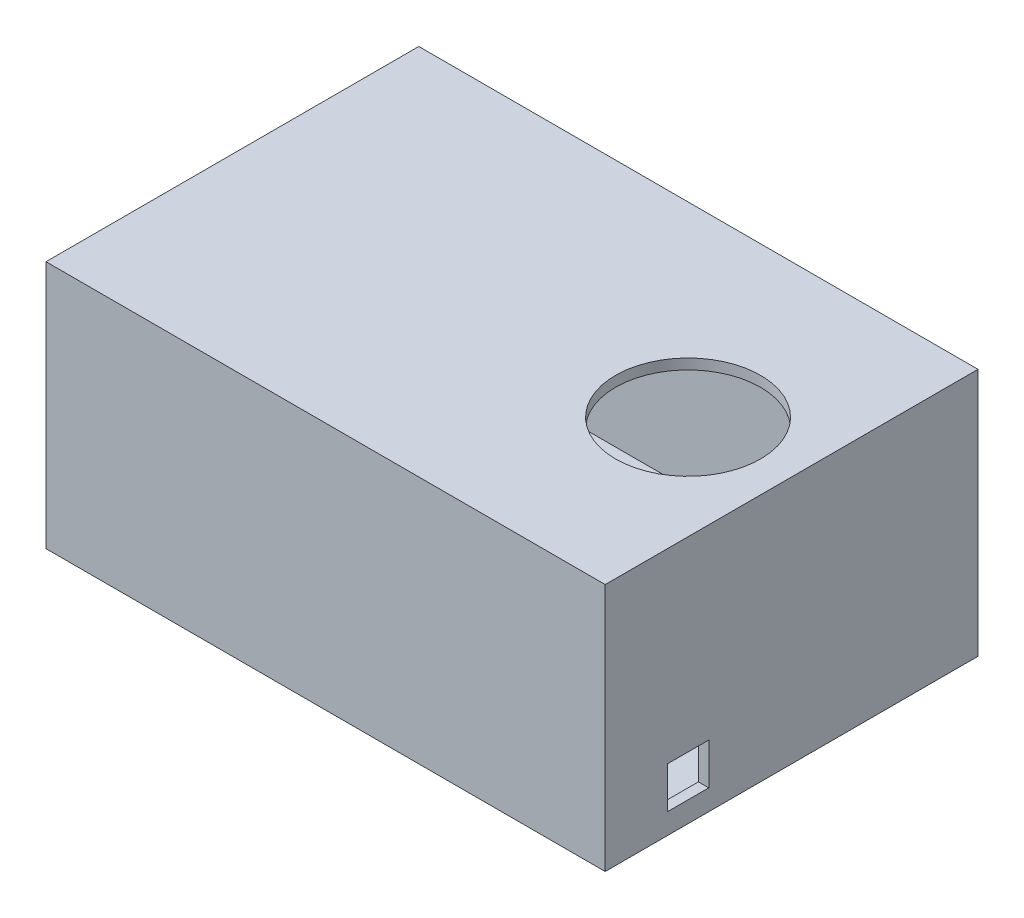
ISO-10303-21;
HEADER;
FILE_DESCRIPTION(('STEP AP214'),'2;1');
FILE_NAME('part.step','',(''),(''),'','','');
FILE_SCHEMA(('AUTOMOTIVE_DESIGN { 1 0 10303 214 1 1 1 1 }'));
ENDSEC;
DATA;
#1=APPLICATION_CONTEXT('core data for automotive mechanical design processes');
#2=APPLICATION_PROTOCOL_DEFINITION('international standard','automotive_design',2000,#1);
#3=PRODUCT_CONTEXT('',#1,'mechanical');
#4=PRODUCT('Part','Part','',(#3));
#5=PRODUCT_RELATED_PRODUCT_CATEGORY('part','',(#4));
#6=PRODUCT_DEFINITION_FORMATION('','',#4);
#7=PRODUCT_DEFINITION_CONTEXT('part definition',#1,'design');
#8=PRODUCT_DEFINITION('design','',#6,#7);
#9=PRODUCT_DEFINITION_SHAPE('','',#8);
#10=(LENGTH_UNIT() NAMED_UNIT(*) SI_UNIT(.MILLI.,.METRE.));
#11=(NAMED_UNIT(*) PLANE_ANGLE_UNIT() SI_UNIT($,.RADIAN.));
#12=(NAMED_UNIT(*) SI_UNIT($,.STERADIAN.) SOLID_ANGLE_UNIT());
#13=UNCERTAINTY_MEASURE_WITH_UNIT(LENGTH_MEASURE(1.E-05),#10,'distance_accuracy_value','');
#14=(GEOMETRIC_REPRESENTATION_CONTEXT(3) GLOBAL_UNCERTAINTY_ASSIGNED_CONTEXT((#13)) GLOBAL_UNIT_ASSIGNED_CONTEXT((#10,
#11,#12)) REPRESENTATION_CONTEXT('',''));
#15=CARTESIAN_POINT('',(0.,0.,0.));
#16=DIRECTION('',(0.,0.,1.));
#17=DIRECTION('',(1.,0.,0.));
#18=AXIS2_PLACEMENT_3D('',#15,#16,#17);
#19=CARTESIAN_POINT('',(0.,152.4,0.));
#20=DIRECTION('',(1.,0.,0.));
#21=DIRECTION('',(0.,0.,-1.));
#22=AXIS2_PLACEMENT_3D('',#19,#20,#21);
#23=PLANE('',#22);
#24=CARTESIAN_POINT('',(0.,76.2,-114.3));
#25=DIRECTION('',(-1.,0.,0.));
#26=DIRECTION('',(0.,0.,1.));
#27=AXIS2_PLACEMENT_3D('',#24,#25,#26);
#28=CIRCLE('',#27,44.45);
#29=CARTESIAN_POINT('',(0.,76.2,-69.85));
#30=VERTEX_POINT('',#29);
#31=EDGE_CURVE('E161',#30,#30,#28,.T.);
#32=ORIENTED_EDGE('',*,*,#31,.F.);
#33=EDGE_LOOP('',(#32));
#34=FACE_BOUND('',#33,.T.);
#35=DIRECTION('',(0.,0.,1.));
#36=VECTOR('',#35,1.);
#37=CARTESIAN_POINT('',(0.,0.,0.));
#38=LINE('',#37,#36);
#39=CARTESIAN_POINT('',(0.,0.,-228.6));
#40=VERTEX_POINT('',#39);
#41=CARTESIAN_POINT('',(0.,0.,0.));
#42=VERTEX_POINT('',#41);
#43=EDGE_CURVE('E170',#40,#42,#38,.T.);
#44=ORIENTED_EDGE('',*,*,#43,.T.);
#45=DIRECTION('',(0.,-1.,0.));
#46=VECTOR('',#45,1.);
#47=CARTESIAN_POINT('',(0.,152.4,0.));
#48=LINE('',#47,#46);
#49=CARTESIAN_POINT('',(0.,152.4,0.));
#50=VERTEX_POINT('',#49);
#51=EDGE_CURVE('E197',#50,#42,#48,.T.);
#52=ORIENTED_EDGE('',*,*,#51,.F.);
#53=DIRECTION('',(0.,0.,1.));
#54=VECTOR('',#53,1.);
#55=CARTESIAN_POINT('',(0.,152.4,0.));
#56=LINE('',#55,#54);
#57=CARTESIAN_POINT('',(0.,152.4,-228.6));
#58=VERTEX_POINT('',#57);
#59=EDGE_CURVE('E171',#58,#50,#56,.T.);
#60=ORIENTED_EDGE('',*,*,#59,.F.);
#61=DIRECTION('',(0.,-1.,0.));
#62=VECTOR('',#61,1.);
#63=CARTESIAN_POINT('',(0.,152.4,-228.6));
#64=LINE('',#63,#62);
#65=EDGE_CURVE('E181',#58,#40,#64,.T.);
#66=ORIENTED_EDGE('',*,*,#65,.T.);
#67=EDGE_LOOP('',(#44,#52,#60,#66));
#68=FACE_BOUND('',#67,.T.);
#69=ADVANCED_FACE('F32',(#34,#68),#23,.F.);
#70=CARTESIAN_POINT('',(0.,152.4,0.));
#71=DIRECTION('',(0.,0.,-1.));
#72=DIRECTION('',(-1.,0.,0.));
#73=AXIS2_PLACEMENT_3D('',#70,#71,#72);
#74=PLANE('',#73);
#75=DIRECTION('',(1.,0.,0.));
#76=VECTOR('',#75,1.);
#77=CARTESIAN_POINT('',(0.,0.,0.));
#78=LINE('',#77,#76);
#79=CARTESIAN_POINT('',(342.9,0.,0.));
#80=VERTEX_POINT('',#79);
#81=EDGE_CURVE('E184',#42,#80,#78,.T.);
#82=ORIENTED_EDGE('',*,*,#81,.T.);
#83=DIRECTION('',(0.,-1.,0.));
#84=VECTOR('',#83,1.);
#85=CARTESIAN_POINT('',(342.9,152.4,0.));
#86=LINE('',#85,#84);
#87=CARTESIAN_POINT('',(342.9,152.4,0.));
#88=VERTEX_POINT('',#87);
#89=EDGE_CURVE('E194',#88,#80,#86,.T.);
#90=ORIENTED_EDGE('',*,*,#89,.F.);
#91=DIRECTION('',(1.,0.,0.));
#92=VECTOR('',#91,1.);
#93=CARTESIAN_POINT('',(0.,152.4,0.));
#94=LINE('',#93,#92);
#95=EDGE_CURVE('E174',#50,#88,#94,.T.);
#96=ORIENTED_EDGE('',*,*,#95,.F.);
#97=ORIENTED_EDGE('',*,*,#51,.T.);
#98=EDGE_LOOP('',(#82,#90,#96,#97));
#99=FACE_BOUND('',#98,.T.);
#100=ADVANCED_FACE('F250',(#99),#74,.F.);
#101=CARTESIAN_POINT('',(342.9,152.4,0.));
#102=DIRECTION('',(-1.,0.,0.));
#103=DIRECTION('',(0.,0.,1.));
#104=AXIS2_PLACEMENT_3D('',#101,#102,#103);
#105=PLANE('',#104);
#106=DIRECTION('',(0.,1.,0.));
#107=VECTOR('',#106,1.);
#108=CARTESIAN_POINT('',(342.9,12.7,-63.5));
#109=LINE('',#108,#107);
#110=CARTESIAN_POINT('',(342.9,12.7,-63.5));
#111=VERTEX_POINT('',#110);
#112=CARTESIAN_POINT('',(342.9,38.1,-63.5));
#113=VERTEX_POINT('',#112);
#114=EDGE_CURVE('E137',#111,#113,#109,.T.);
#115=ORIENTED_EDGE('',*,*,#114,.F.);
#116=DIRECTION('',(0.,0.,-1.));
#117=VECTOR('',#116,1.);
#118=CARTESIAN_POINT('',(342.9,12.7,-38.1));
#119=LINE('',#118,#117);
#120=CARTESIAN_POINT('',(342.9,12.7,-38.1));
#121=VERTEX_POINT('',#120);
#122=EDGE_CURVE('E149',#121,#111,#119,.T.);
#123=ORIENTED_EDGE('',*,*,#122,.F.);
#124=DIRECTION('',(0.,-1.,0.));
#125=VECTOR('',#124,1.);
#126=CARTESIAN_POINT('',(342.9,12.7,-38.1));
#127=LINE('',#126,#125);
#128=CARTESIAN_POINT('',(342.9,38.1,-38.1));
#129=VERTEX_POINT('',#128);
#130=EDGE_CURVE('E147',#129,#121,#127,.T.);
#131=ORIENTED_EDGE('',*,*,#130,.F.);
#132=DIRECTION('',(0.,0.,1.));
#133=VECTOR('',#132,1.);
#134=CARTESIAN_POINT('',(342.9,38.1,-38.1));
#135=LINE('',#134,#133);
#136=EDGE_CURVE('E49',#113,#129,#135,.T.);
#137=ORIENTED_EDGE('',*,*,#136,.F.);
#138=EDGE_LOOP('',(#115,#123,#131,#137));
#139=FACE_BOUND('',#138,.T.);
#140=DIRECTION('',(0.,0.,-1.));
#141=VECTOR('',#140,1.);
#142=CARTESIAN_POINT('',(342.9,0.,0.));
#143=LINE('',#142,#141);
#144=CARTESIAN_POINT('',(342.9,0.,-228.6));
#145=VERTEX_POINT('',#144);
#146=EDGE_CURVE('E186',#80,#145,#143,.T.);
#147=ORIENTED_EDGE('',*,*,#146,.T.);
#148=DIRECTION('',(0.,-1.,0.));
#149=VECTOR('',#148,1.);
#150=CARTESIAN_POINT('',(342.9,152.4,-228.6));
#151=LINE('',#150,#149);
#152=CARTESIAN_POINT('',(342.9,152.4,-228.6));
#153=VERTEX_POINT('',#152);
#154=EDGE_CURVE('E191',#153,#145,#151,.T.);
#155=ORIENTED_EDGE('',*,*,#154,.F.);
#156=DIRECTION('',(0.,0.,-1.));
#157=VECTOR('',#156,1.);
#158=CARTESIAN_POINT('',(342.9,152.4,0.));
#159=LINE('',#158,#157);
#160=EDGE_CURVE('E177',#88,#153,#159,.T.);
#161=ORIENTED_EDGE('',*,*,#160,.F.);
#162=ORIENTED_EDGE('',*,*,#89,.T.);
#163=EDGE_LOOP('',(#147,#155,#161,#162));
#164=FACE_BOUND('',#163,.T.);
#165=ADVANCED_FACE('F256',(#139,#164),#105,.F.);
#166=CARTESIAN_POINT('',(0.,152.4,-228.6));
#167=DIRECTION('',(0.,0.,1.));
#168=DIRECTION('',(1.,0.,0.));
#169=AXIS2_PLACEMENT_3D('',#166,#167,#168);
#170=PLANE('',#169);
#171=DIRECTION('',(-1.,0.,0.));
#172=VECTOR('',#171,1.);
#173=CARTESIAN_POINT('',(0.,0.,-228.6));
#174=LINE('',#173,#172);
#175=EDGE_CURVE('E175',#145,#40,#174,.T.);
#176=ORIENTED_EDGE('',*,*,#175,.T.);
#177=ORIENTED_EDGE('',*,*,#65,.F.);
#178=DIRECTION('',(-1.,0.,0.));
#179=VECTOR('',#178,1.);
#180=CARTESIAN_POINT('',(0.,152.4,-228.6));
#181=LINE('',#180,#179);
#182=EDGE_CURVE('E179',#153,#58,#181,.T.);
#183=ORIENTED_EDGE('',*,*,#182,.F.);
#184=ORIENTED_EDGE('',*,*,#154,.T.);
#185=EDGE_LOOP('',(#176,#177,#183,#184));
#186=FACE_BOUND('',#185,.T.);
#187=ADVANCED_FACE('F335',(#186),#170,.F.);
#188=CARTESIAN_POINT('',(0.,152.4,0.));
#189=DIRECTION('',(0.,-1.,0.));
#190=DIRECTION('',(0.,0.,-1.));
#191=AXIS2_PLACEMENT_3D('',#188,#189,#190);
#192=PLANE('',#191);
#193=CARTESIAN_POINT('',(279.4,152.4,-114.3));
#194=DIRECTION('',(0.,1.,0.));
#195=DIRECTION('',(0.,0.,1.));
#196=AXIS2_PLACEMENT_3D('',#193,#194,#195);
#197=CIRCLE('',#196,44.45);
#198=CARTESIAN_POINT('',(279.4,152.4,-69.85));
#199=VERTEX_POINT('',#198);
#200=EDGE_CURVE('E167',#199,#199,#197,.T.);
#201=ORIENTED_EDGE('',*,*,#200,.F.);
#202=EDGE_LOOP('',(#201));
#203=FACE_BOUND('',#202,.T.);
#204=ORIENTED_EDGE('',*,*,#59,.T.);
#205=ORIENTED_EDGE('',*,*,#95,.T.);
#206=ORIENTED_EDGE('',*,*,#160,.T.);
#207=ORIENTED_EDGE('',*,*,#182,.T.);
#208=EDGE_LOOP('',(#204,#205,#206,#207));
#209=FACE_BOUND('',#208,.T.);
#210=ADVANCED_FACE('F332',(#203,#209),#192,.F.);
#211=CARTESIAN_POINT('',(0.,0.,0.));
#212=DIRECTION('',(0.,-1.,0.));
#213=DIRECTION('',(0.,0.,-1.));
#214=AXIS2_PLACEMENT_3D('',#211,#212,#213);
#215=PLANE('',#214);
#216=ORIENTED_EDGE('',*,*,#43,.F.);
#217=ORIENTED_EDGE('',*,*,#175,.F.);
#218=ORIENTED_EDGE('',*,*,#146,.F.);
#219=ORIENTED_EDGE('',*,*,#81,.F.);
#220=EDGE_LOOP('',(#216,#217,#218,#219));
#221=FACE_BOUND('',#220,.T.);
#222=ADVANCED_FACE('F330',(#221),#215,.T.);
#223=CARTESIAN_POINT('',(279.4,-0.001000000000001,-114.3));
#224=DIRECTION('',(0.,1.,0.));
#225=DIRECTION('',(0.,0.,1.));
#226=AXIS2_PLACEMENT_3D('',#223,#224,#225);
#227=CYLINDRICAL_SURFACE('',#226,44.45);
#228=CARTESIAN_POINT('',(279.4,146.05,-114.3));
#229=DIRECTION('',(0.,-1.,0.));
#230=DIRECTION('',(0.,0.,-1.));
#231=AXIS2_PLACEMENT_3D('',#228,#229,#230);
#232=CIRCLE('',#231,44.45);
#233=CARTESIAN_POINT('',(279.4,146.05,-158.75));
#234=VERTEX_POINT('',#233);
#235=EDGE_CURVE('E164',#234,#234,#232,.F.);
#236=ORIENTED_EDGE('',*,*,#235,.F.);
#237=EDGE_LOOP('',(#236));
#238=FACE_BOUND('',#237,.T.);
#239=ORIENTED_EDGE('',*,*,#200,.T.);
#240=EDGE_LOOP('',(#239));
#241=FACE_BOUND('',#240,.T.);
#242=ADVANCED_FACE('F265',(#238,#241),#227,.F.);
#243=CARTESIAN_POINT('',(6.35,152.4,0.));
#244=DIRECTION('',(1.,0.,0.));
#245=DIRECTION('',(0.,0.,-1.));
#246=AXIS2_PLACEMENT_3D('',#243,#244,#245);
#247=PLANE('',#246);
#248=CARTESIAN_POINT('',(6.35000000000002,76.2,-114.3));
#249=DIRECTION('',(1.,0.,0.));
#250=DIRECTION('',(0.,0.,-1.));
#251=AXIS2_PLACEMENT_3D('',#248,#249,#250);
#252=CIRCLE('',#251,44.45);
#253=CARTESIAN_POINT('',(6.35000000000002,76.2,-158.75));
#254=VERTEX_POINT('',#253);
#255=EDGE_CURVE('E158',#254,#254,#252,.F.);
#256=ORIENTED_EDGE('',*,*,#255,.T.);
#257=EDGE_LOOP('',(#256));
#258=FACE_BOUND('',#257,.T.);
#259=DIRECTION('',(0.,0.,1.));
#260=VECTOR('',#259,1.);
#261=CARTESIAN_POINT('',(6.35,6.35,0.));
#262=LINE('',#261,#260);
#263=CARTESIAN_POINT('',(6.35,6.35,-222.25));
#264=VERTEX_POINT('',#263);
#265=CARTESIAN_POINT('',(6.35,6.35,-6.35));
#266=VERTEX_POINT('',#265);
#267=EDGE_CURVE('E36',#264,#266,#262,.T.);
#268=ORIENTED_EDGE('',*,*,#267,.F.);
#269=DIRECTION('',(0.,-1.,0.));
#270=VECTOR('',#269,1.);
#271=CARTESIAN_POINT('',(6.35,152.4,-222.25));
#272=LINE('',#271,#270);
#273=CARTESIAN_POINT('',(6.35,146.05,-222.25));
#274=VERTEX_POINT('',#273);
#275=EDGE_CURVE('E220',#274,#264,#272,.T.);
#276=ORIENTED_EDGE('',*,*,#275,.F.);
#277=DIRECTION('',(0.,0.,1.));
#278=VECTOR('',#277,1.);
#279=CARTESIAN_POINT('',(6.35,146.05,0.));
#280=LINE('',#279,#278);
#281=CARTESIAN_POINT('',(6.35,146.05,-6.35));
#282=VERTEX_POINT('',#281);
#283=EDGE_CURVE('E203',#274,#282,#280,.T.);
#284=ORIENTED_EDGE('',*,*,#283,.T.);
#285=DIRECTION('',(0.,-1.,0.));
#286=VECTOR('',#285,1.);
#287=CARTESIAN_POINT('',(6.35,152.4,-6.35));
#288=LINE('',#287,#286);
#289=EDGE_CURVE('E216',#282,#266,#288,.T.);
#290=ORIENTED_EDGE('',*,*,#289,.T.);
#291=EDGE_LOOP('',(#268,#276,#284,#290));
#292=FACE_BOUND('',#291,.T.);
#293=ADVANCED_FACE('F229',(#258,#292),#247,.T.);
#294=CARTESIAN_POINT('',(0.,152.4,-6.35));
#295=DIRECTION('',(0.,0.,-1.));
#296=DIRECTION('',(-1.,0.,0.));
#297=AXIS2_PLACEMENT_3D('',#294,#295,#296);
#298=PLANE('',#297);
#299=DIRECTION('',(1.,0.,0.));
#300=VECTOR('',#299,1.);
#301=CARTESIAN_POINT('',(0.,6.35,-6.35));
#302=LINE('',#301,#300);
#303=CARTESIAN_POINT('',(336.55,6.35,-6.35));
#304=VERTEX_POINT('',#303);
#305=EDGE_CURVE('E219',#266,#304,#302,.T.);
#306=ORIENTED_EDGE('',*,*,#305,.F.);
#307=ORIENTED_EDGE('',*,*,#289,.F.);
#308=DIRECTION('',(1.,0.,0.));
#309=VECTOR('',#308,1.);
#310=CARTESIAN_POINT('',(0.,146.05,-6.35));
#311=LINE('',#310,#309);
#312=CARTESIAN_POINT('',(336.55,146.05,-6.35));
#313=VERTEX_POINT('',#312);
#314=EDGE_CURVE('E201',#282,#313,#311,.T.);
#315=ORIENTED_EDGE('',*,*,#314,.T.);
#316=DIRECTION('',(0.,-1.,0.));
#317=VECTOR('',#316,1.);
#318=CARTESIAN_POINT('',(336.55,152.4,-6.35));
#319=LINE('',#318,#317);
#320=EDGE_CURVE('E211',#313,#304,#319,.T.);
#321=ORIENTED_EDGE('',*,*,#320,.T.);
#322=EDGE_LOOP('',(#306,#307,#315,#321));
#323=FACE_BOUND('',#322,.T.);
#324=ADVANCED_FACE('F233',(#323),#298,.T.);
#325=CARTESIAN_POINT('',(336.55,152.4,0.));
#326=DIRECTION('',(-1.,0.,0.));
#327=DIRECTION('',(0.,0.,1.));
#328=AXIS2_PLACEMENT_3D('',#325,#326,#327);
#329=PLANE('',#328);
#330=DIRECTION('',(0.,0.,-1.));
#331=VECTOR('',#330,1.);
#332=CARTESIAN_POINT('',(336.55,12.7,-38.1));
#333=LINE('',#332,#331);
#334=CARTESIAN_POINT('',(336.55,12.7,-38.1));
#335=VERTEX_POINT('',#334);
#336=CARTESIAN_POINT('',(336.55,12.7,-63.5));
#337=VERTEX_POINT('',#336);
#338=EDGE_CURVE('E143',#335,#337,#333,.T.);
#339=ORIENTED_EDGE('',*,*,#338,.T.);
#340=DIRECTION('',(0.,1.,0.));
#341=VECTOR('',#340,1.);
#342=CARTESIAN_POINT('',(336.55,12.7,-63.5));
#343=LINE('',#342,#341);
#344=CARTESIAN_POINT('',(336.55,38.1,-63.5));
#345=VERTEX_POINT('',#344);
#346=EDGE_CURVE('E131',#337,#345,#343,.T.);
#347=ORIENTED_EDGE('',*,*,#346,.T.);
#348=DIRECTION('',(0.,0.,1.));
#349=VECTOR('',#348,1.);
#350=CARTESIAN_POINT('',(336.55,38.1,-38.1));
#351=LINE('',#350,#349);
#352=CARTESIAN_POINT('',(336.55,38.1,-38.1));
#353=VERTEX_POINT('',#352);
#354=EDGE_CURVE('E121',#345,#353,#351,.T.);
#355=ORIENTED_EDGE('',*,*,#354,.T.);
#356=DIRECTION('',(0.,-1.,0.));
#357=VECTOR('',#356,1.);
#358=CARTESIAN_POINT('',(336.55,12.7,-38.1));
#359=LINE('',#358,#357);
#360=EDGE_CURVE('E130',#353,#335,#359,.T.);
#361=ORIENTED_EDGE('',*,*,#360,.T.);
#362=EDGE_LOOP('',(#339,#347,#355,#361));
#363=FACE_BOUND('',#362,.T.);
#364=DIRECTION('',(0.,0.,-1.));
#365=VECTOR('',#364,1.);
#366=CARTESIAN_POINT('',(336.55,6.35,0.));
#367=LINE('',#366,#365);
#368=CARTESIAN_POINT('',(336.55,6.35,-222.25));
#369=VERTEX_POINT('',#368);
#370=EDGE_CURVE('E214',#304,#369,#367,.T.);
#371=ORIENTED_EDGE('',*,*,#370,.F.);
#372=ORIENTED_EDGE('',*,*,#320,.F.);
#373=DIRECTION('',(0.,0.,-1.));
#374=VECTOR('',#373,1.);
#375=CARTESIAN_POINT('',(336.55,146.05,0.));
#376=LINE('',#375,#374);
#377=CARTESIAN_POINT('',(336.55,146.05,-222.25));
#378=VERTEX_POINT('',#377);
#379=EDGE_CURVE('E41',#313,#378,#376,.T.);
#380=ORIENTED_EDGE('',*,*,#379,.T.);
#381=DIRECTION('',(0.,-1.,0.));
#382=VECTOR('',#381,1.);
#383=CARTESIAN_POINT('',(336.55,152.4,-222.25));
#384=LINE('',#383,#382);
#385=EDGE_CURVE('E206',#378,#369,#384,.T.);
#386=ORIENTED_EDGE('',*,*,#385,.T.);
#387=EDGE_LOOP('',(#371,#372,#380,#386));
#388=FACE_BOUND('',#387,.T.);
#389=ADVANCED_FACE('F141',(#363,#388),#329,.T.);
#390=CARTESIAN_POINT('',(0.,152.4,-222.25));
#391=DIRECTION('',(0.,0.,1.));
#392=DIRECTION('',(1.,0.,0.));
#393=AXIS2_PLACEMENT_3D('',#390,#391,#392);
#394=PLANE('',#393);
#395=DIRECTION('',(-1.,0.,0.));
#396=VECTOR('',#395,1.);
#397=CARTESIAN_POINT('',(0.,6.35,-222.25));
#398=LINE('',#397,#396);
#399=EDGE_CURVE('E209',#369,#264,#398,.T.);
#400=ORIENTED_EDGE('',*,*,#399,.F.);
#401=ORIENTED_EDGE('',*,*,#385,.F.);
#402=DIRECTION('',(-1.,0.,0.));
#403=VECTOR('',#402,1.);
#404=CARTESIAN_POINT('',(0.,146.05,-222.25));
#405=LINE('',#404,#403);
#406=EDGE_CURVE('E11',#378,#274,#405,.T.);
#407=ORIENTED_EDGE('',*,*,#406,.T.);
#408=ORIENTED_EDGE('',*,*,#275,.T.);
#409=EDGE_LOOP('',(#400,#401,#407,#408));
#410=FACE_BOUND('',#409,.T.);
#411=ADVANCED_FACE('F239',(#410),#394,.T.);
#412=CARTESIAN_POINT('',(0.,146.05,0.));
#413=DIRECTION('',(0.,-1.,0.));
#414=DIRECTION('',(0.,0.,-1.));
#415=AXIS2_PLACEMENT_3D('',#412,#413,#414);
#416=PLANE('',#415);
#417=ORIENTED_EDGE('',*,*,#235,.T.);
#418=EDGE_LOOP('',(#417));
#419=FACE_BOUND('',#418,.T.);
#420=ORIENTED_EDGE('',*,*,#283,.F.);
#421=ORIENTED_EDGE('',*,*,#406,.F.);
#422=ORIENTED_EDGE('',*,*,#379,.F.);
#423=ORIENTED_EDGE('',*,*,#314,.F.);
#424=EDGE_LOOP('',(#420,#421,#422,#423));
#425=FACE_BOUND('',#424,.T.);
#426=ADVANCED_FACE('F241',(#419,#425),#416,.T.);
#427=CARTESIAN_POINT('',(0.,6.35,0.));
#428=DIRECTION('',(0.,-1.,0.));
#429=DIRECTION('',(0.,0.,-1.));
#430=AXIS2_PLACEMENT_3D('',#427,#428,#429);
#431=PLANE('',#430);
#432=ORIENTED_EDGE('',*,*,#267,.T.);
#433=ORIENTED_EDGE('',*,*,#305,.T.);
#434=ORIENTED_EDGE('',*,*,#370,.T.);
#435=ORIENTED_EDGE('',*,*,#399,.T.);
#436=EDGE_LOOP('',(#432,#433,#434,#435));
#437=FACE_BOUND('',#436,.T.);
#438=ADVANCED_FACE('F34',(#437),#431,.F.);
#439=CARTESIAN_POINT('',(342.901,76.2,-114.3));
#440=DIRECTION('',(-1.,0.,0.));
#441=DIRECTION('',(0.,0.,1.));
#442=AXIS2_PLACEMENT_3D('',#439,#440,#441);
#443=CYLINDRICAL_SURFACE('',#442,44.45);
#444=ORIENTED_EDGE('',*,*,#255,.F.);
#445=EDGE_LOOP('',(#444));
#446=FACE_BOUND('',#445,.T.);
#447=ORIENTED_EDGE('',*,*,#31,.T.);
#448=EDGE_LOOP('',(#447));
#449=FACE_BOUND('',#448,.T.);
#450=ADVANCED_FACE('F294',(#446,#449),#443,.F.);
#451=CARTESIAN_POINT('',(-0.000999999999973245,12.7,-38.1));
#452=DIRECTION('',(0.,-1.,0.));
#453=DIRECTION('',(0.,0.,-1.));
#454=AXIS2_PLACEMENT_3D('',#451,#452,#453);
#455=PLANE('',#454);
#456=DIRECTION('',(1.,0.,0.));
#457=VECTOR('',#456,1.);
#458=CARTESIAN_POINT('',(-0.000999999999973245,12.7,-38.1));
#459=LINE('',#458,#457);
#460=EDGE_CURVE('E57',#335,#121,#459,.T.);
#461=ORIENTED_EDGE('',*,*,#460,.T.);
#462=ORIENTED_EDGE('',*,*,#122,.T.);
#463=DIRECTION('',(1.,0.,0.));
#464=VECTOR('',#463,1.);
#465=CARTESIAN_POINT('',(-0.000999999999973245,12.7,-63.5));
#466=LINE('',#465,#464);
#467=EDGE_CURVE('E138',#337,#111,#466,.T.);
#468=ORIENTED_EDGE('',*,*,#467,.F.);
#469=ORIENTED_EDGE('',*,*,#338,.F.);
#470=EDGE_LOOP('',(#461,#462,#468,#469));
#471=FACE_BOUND('',#470,.T.);
#472=ADVANCED_FACE('F289',(#471),#455,.F.);
#473=CARTESIAN_POINT('',(-0.000999999999973245,12.7,-63.5));
#474=DIRECTION('',(0.,0.,-1.));
#475=DIRECTION('',(-1.,0.,0.));
#476=AXIS2_PLACEMENT_3D('',#473,#474,#475);
#477=PLANE('',#476);
#478=ORIENTED_EDGE('',*,*,#467,.T.);
#479=ORIENTED_EDGE('',*,*,#114,.T.);
#480=DIRECTION('',(1.,0.,0.));
#481=VECTOR('',#480,1.);
#482=CARTESIAN_POINT('',(-0.000999999999973245,38.1,-63.5));
#483=LINE('',#482,#481);
#484=EDGE_CURVE('E124',#345,#113,#483,.T.);
#485=ORIENTED_EDGE('',*,*,#484,.F.);
#486=ORIENTED_EDGE('',*,*,#346,.F.);
#487=EDGE_LOOP('',(#478,#479,#485,#486));
#488=FACE_BOUND('',#487,.T.);
#489=ADVANCED_FACE('F134',(#488),#477,.F.);
#490=CARTESIAN_POINT('',(-0.000999999999973245,38.1,-38.1));
#491=DIRECTION('',(0.,1.,0.));
#492=DIRECTION('',(0.,0.,1.));
#493=AXIS2_PLACEMENT_3D('',#490,#491,#492);
#494=PLANE('',#493);
#495=ORIENTED_EDGE('',*,*,#484,.T.);
#496=ORIENTED_EDGE('',*,*,#136,.T.);
#497=DIRECTION('',(1.,0.,0.));
#498=VECTOR('',#497,1.);
#499=CARTESIAN_POINT('',(-0.000999999999973245,38.1,-38.1));
#500=LINE('',#499,#498);
#501=EDGE_CURVE('E126',#353,#129,#500,.T.);
#502=ORIENTED_EDGE('',*,*,#501,.F.);
#503=ORIENTED_EDGE('',*,*,#354,.F.);
#504=EDGE_LOOP('',(#495,#496,#502,#503));
#505=FACE_BOUND('',#504,.T.);
#506=ADVANCED_FACE('F123',(#505),#494,.F.);
#507=CARTESIAN_POINT('',(-0.000999999999973245,12.7,-38.1));
#508=DIRECTION('',(0.,0.,1.));
#509=DIRECTION('',(0.,-1.,0.));
#510=AXIS2_PLACEMENT_3D('',#507,#508,#509);
#511=PLANE('',#510);
#512=ORIENTED_EDGE('',*,*,#501,.T.);
#513=ORIENTED_EDGE('',*,*,#130,.T.);
#514=ORIENTED_EDGE('',*,*,#460,.F.);
#515=ORIENTED_EDGE('',*,*,#360,.F.);
#516=EDGE_LOOP('',(#512,#513,#514,#515));
#517=FACE_BOUND('',#516,.T.);
#518=ADVANCED_FACE('F314',(#517),#511,.F.);
#519=CLOSED_SHELL('',(#69,#100,#165,#187,#210,#222,#242,#293,#324,#389,#411,#426,#438,#450,#472,
#489,#506,#518));
#520=MANIFOLD_SOLID_BREP('B2',#519);
#521=ADVANCED_BREP_SHAPE_REPRESENTATION('',(#18,#520),#14);
#522=SHAPE_DEFINITION_REPRESENTATION(#9,#521);
ENDSEC;
END-ISO-10303-21;
